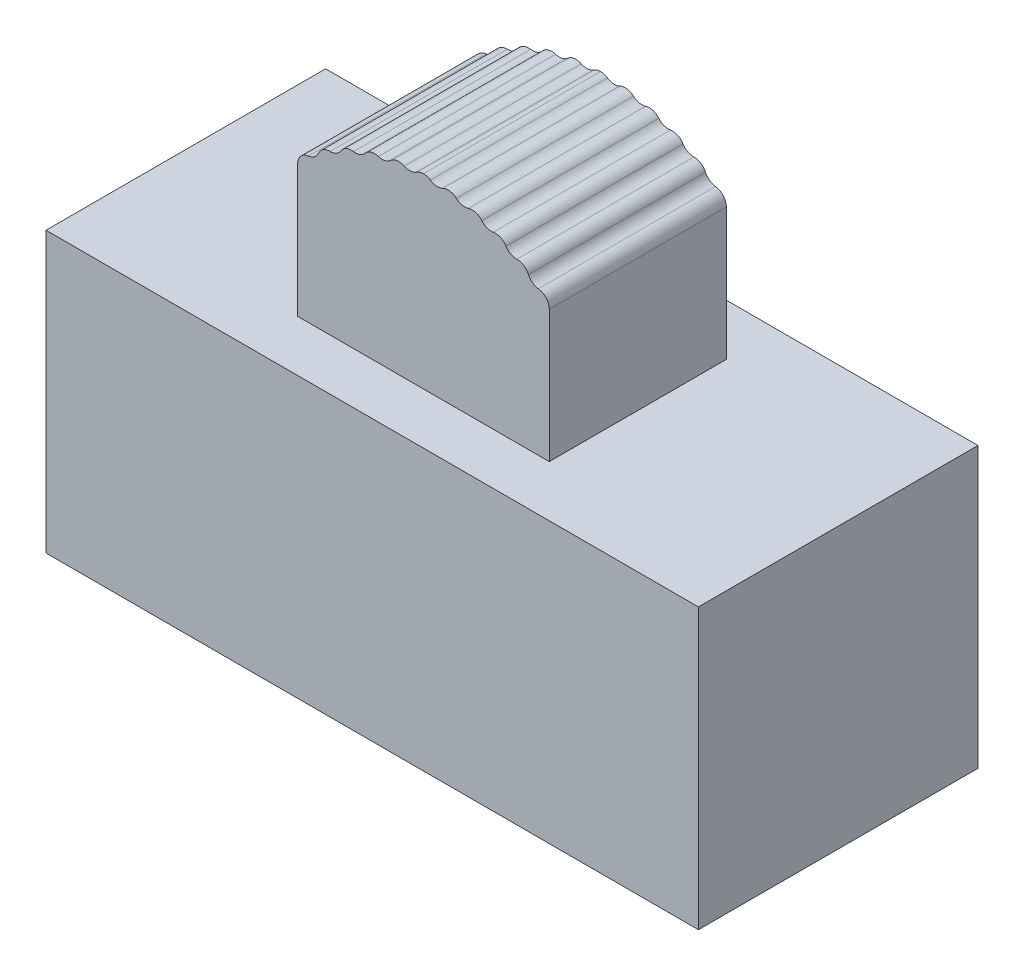
ISO-10303-21;
HEADER;
FILE_DESCRIPTION(('STEP AP214'),'2;1');
FILE_NAME('part.step','',(''),(''),'','','');
FILE_SCHEMA(('AUTOMOTIVE_DESIGN { 1 0 10303 214 1 1 1 1 }'));
ENDSEC;
DATA;
#1=APPLICATION_CONTEXT('core data for automotive mechanical design processes');
#2=APPLICATION_PROTOCOL_DEFINITION('international standard','automotive_design',2000,#1);
#3=PRODUCT_CONTEXT('',#1,'mechanical');
#4=PRODUCT('Part','Part','',(#3));
#5=PRODUCT_RELATED_PRODUCT_CATEGORY('part','',(#4));
#6=PRODUCT_DEFINITION_FORMATION('','',#4);
#7=PRODUCT_DEFINITION_CONTEXT('part definition',#1,'design');
#8=PRODUCT_DEFINITION('design','',#6,#7);
#9=PRODUCT_DEFINITION_SHAPE('','',#8);
#10=(LENGTH_UNIT() NAMED_UNIT(*) SI_UNIT(.MILLI.,.METRE.));
#11=(NAMED_UNIT(*) PLANE_ANGLE_UNIT() SI_UNIT($,.RADIAN.));
#12=(NAMED_UNIT(*) SI_UNIT($,.STERADIAN.) SOLID_ANGLE_UNIT());
#13=UNCERTAINTY_MEASURE_WITH_UNIT(LENGTH_MEASURE(1.E-05),#10,'distance_accuracy_value','');
#14=(GEOMETRIC_REPRESENTATION_CONTEXT(3) GLOBAL_UNCERTAINTY_ASSIGNED_CONTEXT((#13)) GLOBAL_UNIT_ASSIGNED_CONTEXT((#10,
#11,#12)) REPRESENTATION_CONTEXT('',''));
#15=CARTESIAN_POINT('',(0.,0.,0.));
#16=DIRECTION('',(0.,0.,1.));
#17=DIRECTION('',(1.,0.,0.));
#18=AXIS2_PLACEMENT_3D('',#15,#16,#17);
#19=CARTESIAN_POINT('',(-2.7,10.,1.9));
#20=DIRECTION('',(0.,0.,-1.));
#21=DIRECTION('',(-1.,0.,0.));
#22=AXIS2_PLACEMENT_3D('',#19,#20,#21);
#23=PLANE('',#22);
#24=DIRECTION('',(0.,-1.,0.));
#25=VECTOR('',#24,1.);
#26=CARTESIAN_POINT('',(2.7,10.,1.9));
#27=LINE('',#26,#25);
#28=CARTESIAN_POINT('',(2.7,8.83213700233587,1.9));
#29=VERTEX_POINT('',#28);
#30=CARTESIAN_POINT('',(2.7,6.,1.9));
#31=VERTEX_POINT('',#30);
#32=EDGE_CURVE('E277',#29,#31,#27,.T.);
#33=ORIENTED_EDGE('',*,*,#32,.F.);
#34=CARTESIAN_POINT('',(2.435,8.83213700233587,1.9));
#35=DIRECTION('',(0.,0.,1.));
#36=DIRECTION('',(1.,0.,0.));
#37=AXIS2_PLACEMENT_3D('',#34,#35,#36);
#38=CIRCLE('',#37,0.265000000000001);
#39=CARTESIAN_POINT('',(2.46554808183589,9.09537038679944,1.9));
#40=VERTEX_POINT('',#39);
#41=EDGE_CURVE('E49',#40,#29,#38,.F.);
#42=ORIENTED_EDGE('',*,*,#41,.F.);
#43=CARTESIAN_POINT('',(2.49609616367178,9.35860377126302,1.9));
#44=DIRECTION('',(0.,0.,1.));
#45=DIRECTION('',(1.,0.,0.));
#46=AXIS2_PLACEMENT_3D('',#43,#44,#45);
#47=CIRCLE('',#46,0.265);
#48=CARTESIAN_POINT('',(2.25285532468423,9.253442493938,1.9));
#49=VERTEX_POINT('',#48);
#50=EDGE_CURVE('E512',#40,#49,#47,.F.);
#51=ORIENTED_EDGE('',*,*,#50,.T.);
#52=CARTESIAN_POINT('',(2.00961448569667,9.14828121661298,1.9));
#53=DIRECTION('',(0.,0.,1.));
#54=DIRECTION('',(1.,0.,0.));
#55=AXIS2_PLACEMENT_3D('',#52,#53,#54);
#56=CIRCLE('',#55,0.265);
#57=CARTESIAN_POINT('',(2.0025960831141,9.41318826073448,1.9));
#58=VERTEX_POINT('',#57);
#59=EDGE_CURVE('E516',#58,#49,#56,.F.);
#60=ORIENTED_EDGE('',*,*,#59,.F.);
#61=CARTESIAN_POINT('',(1.99557768053153,9.67809530485597,1.9));
#62=DIRECTION('',(0.,0.,1.));
#63=DIRECTION('',(1.,0.,0.));
#64=AXIS2_PLACEMENT_3D('',#61,#62,#63);
#65=CIRCLE('',#64,0.265);
#66=CARTESIAN_POINT('',(1.76967065197215,9.53956366786473,1.9));
#67=VERTEX_POINT('',#66);
#68=EDGE_CURVE('E372',#58,#67,#65,.F.);
#69=ORIENTED_EDGE('',*,*,#68,.T.);
#70=CARTESIAN_POINT('',(1.54376362341278,9.40103203087349,1.9));
#71=DIRECTION('',(0.,0.,1.));
#72=DIRECTION('',(1.,0.,0.));
#73=AXIS2_PLACEMENT_3D('',#70,#71,#72);
#74=CIRCLE('',#73,0.265);
#75=CARTESIAN_POINT('',(1.49932005809547,9.66227859927562,1.9));
#76=VERTEX_POINT('',#75);
#77=EDGE_CURVE('E519',#76,#67,#74,.F.);
#78=ORIENTED_EDGE('',*,*,#77,.F.);
#79=CARTESIAN_POINT('',(1.45487649277817,9.92352516767774,1.9));
#80=DIRECTION('',(0.,0.,1.));
#81=DIRECTION('',(1.,0.,0.));
#82=AXIS2_PLACEMENT_3D('',#79,#80,#81);
#83=CIRCLE('',#82,0.265);
#84=CARTESIAN_POINT('',(1.25085211054907,9.75441262687714,1.9));
#85=VERTEX_POINT('',#84);
#86=EDGE_CURVE('E522',#76,#85,#83,.F.);
#87=ORIENTED_EDGE('',*,*,#86,.T.);
#88=CARTESIAN_POINT('',(1.04682772831997,9.58530008607654,1.9));
#89=DIRECTION('',(0.,0.,1.));
#90=DIRECTION('',(1.,0.,0.));
#91=AXIS2_PLACEMENT_3D('',#88,#89,#90);
#92=CIRCLE('',#91,0.264999999999999);
#93=CARTESIAN_POINT('',(0.965853910385703,9.83762575026698,1.9));
#94=VERTEX_POINT('',#93);
#95=EDGE_CURVE('E525',#94,#85,#92,.F.);
#96=ORIENTED_EDGE('',*,*,#95,.F.);
#97=CARTESIAN_POINT('',(0.884880092451435,10.0899514144574,1.9));
#98=DIRECTION('',(0.,0.,1.));
#99=DIRECTION('',(1.,0.,0.));
#100=AXIS2_PLACEMENT_3D('',#97,#98,#99);
#101=CIRCLE('',#100,0.265);
#102=CARTESIAN_POINT('',(0.706846566202864,9.89366319898971,1.9));
#103=VERTEX_POINT('',#102);
#104=EDGE_CURVE('E528',#94,#103,#101,.F.);
#105=ORIENTED_EDGE('',*,*,#104,.T.);
#106=CARTESIAN_POINT('',(0.528813039954295,9.697374983522,1.9));
#107=DIRECTION('',(0.,0.,1.));
#108=DIRECTION('',(1.,0.,0.));
#109=AXIS2_PLACEMENT_3D('',#106,#107,#108);
#110=CIRCLE('',#109,0.265);
#111=CARTESIAN_POINT('',(0.412939448155752,9.93569894522897,1.9));
#112=VERTEX_POINT('',#111);
#113=EDGE_CURVE('E531',#112,#103,#110,.F.);
#114=ORIENTED_EDGE('',*,*,#113,.F.);
#115=CARTESIAN_POINT('',(0.29706585635721,10.1740229069359,1.9));
#116=DIRECTION('',(0.,0.,1.));
#117=DIRECTION('',(1.,0.,0.));
#118=AXIS2_PLACEMENT_3D('',#115,#116,#117);
#119=CIRCLE('',#118,0.264999999999999);
#120=CARTESIAN_POINT('',(0.148608047087697,9.95451145195717,1.9));
#121=VERTEX_POINT('',#120);
#122=EDGE_CURVE('E250',#112,#121,#119,.F.);
#123=ORIENTED_EDGE('',*,*,#122,.T.);
#124=CARTESIAN_POINT('',(0.000150237818182658,9.7349999969784,1.9));
#125=DIRECTION('',(0.,0.,1.));
#126=DIRECTION('',(1.,0.,0.));
#127=AXIS2_PLACEMENT_3D('',#124,#125,#126);
#128=CIRCLE('',#127,0.265);
#129=CARTESIAN_POINT('',(0.000160897261775262,10.,1.9));
#130=VERTEX_POINT('',#129);
#131=EDGE_CURVE('E235',#130,#121,#128,.F.);
#132=ORIENTED_EDGE('',*,*,#131,.F.);
#133=DIRECTION('',(1.,0.,0.));
#134=VECTOR('',#133,1.);
#135=CARTESIAN_POINT('',(-2.7,10.,1.9));
#136=LINE('',#135,#134);
#137=CARTESIAN_POINT('',(-0.000160897261775213,10.,1.9));
#138=VERTEX_POINT('',#137);
#139=EDGE_CURVE('E247',#138,#130,#136,.T.);
#140=ORIENTED_EDGE('',*,*,#139,.F.);
#141=CARTESIAN_POINT('',(-0.000150237818182658,9.7349999969784,1.9));
#142=DIRECTION('',(0.,0.,1.));
#143=DIRECTION('',(1.,0.,0.));
#144=AXIS2_PLACEMENT_3D('',#141,#142,#143);
#145=CIRCLE('',#144,0.265);
#146=CARTESIAN_POINT('',(-0.148608047087696,9.95451145195717,1.9));
#147=VERTEX_POINT('',#146);
#148=EDGE_CURVE('E57',#138,#147,#145,.T.);
#149=ORIENTED_EDGE('',*,*,#148,.T.);
#150=CARTESIAN_POINT('',(-0.29706585635721,10.1740229069359,1.9));
#151=DIRECTION('',(0.,0.,1.));
#152=DIRECTION('',(1.,0.,0.));
#153=AXIS2_PLACEMENT_3D('',#150,#151,#152);
#154=CIRCLE('',#153,0.264999999999999);
#155=CARTESIAN_POINT('',(-0.412939448155752,9.93569894522897,1.9));
#156=VERTEX_POINT('',#155);
#157=EDGE_CURVE('E398',#156,#147,#154,.T.);
#158=ORIENTED_EDGE('',*,*,#157,.F.);
#159=CARTESIAN_POINT('',(-0.528813039954295,9.697374983522,1.9));
#160=DIRECTION('',(0.,0.,1.));
#161=DIRECTION('',(1.,0.,0.));
#162=AXIS2_PLACEMENT_3D('',#159,#160,#161);
#163=CIRCLE('',#162,0.265);
#164=CARTESIAN_POINT('',(-0.706846566202865,9.89366319898971,1.9));
#165=VERTEX_POINT('',#164);
#166=EDGE_CURVE('E395',#156,#165,#163,.T.);
#167=ORIENTED_EDGE('',*,*,#166,.T.);
#168=CARTESIAN_POINT('',(-0.884880092451435,10.0899514144574,1.9));
#169=DIRECTION('',(0.,0.,1.));
#170=DIRECTION('',(1.,0.,0.));
#171=AXIS2_PLACEMENT_3D('',#168,#169,#170);
#172=CIRCLE('',#171,0.265);
#173=CARTESIAN_POINT('',(-0.965853910385703,9.83762575026698,1.9));
#174=VERTEX_POINT('',#173);
#175=EDGE_CURVE('E423',#174,#165,#172,.T.);
#176=ORIENTED_EDGE('',*,*,#175,.F.);
#177=CARTESIAN_POINT('',(-1.04682772831997,9.58530008607654,1.9));
#178=DIRECTION('',(0.,0.,1.));
#179=DIRECTION('',(1.,0.,0.));
#180=AXIS2_PLACEMENT_3D('',#177,#178,#179);
#181=CIRCLE('',#180,0.264999999999999);
#182=CARTESIAN_POINT('',(-1.25085211054907,9.75441262687714,1.9));
#183=VERTEX_POINT('',#182);
#184=EDGE_CURVE('E420',#174,#183,#181,.T.);
#185=ORIENTED_EDGE('',*,*,#184,.T.);
#186=CARTESIAN_POINT('',(-1.45487649277817,9.92352516767774,1.9));
#187=DIRECTION('',(0.,0.,1.));
#188=DIRECTION('',(1.,0.,0.));
#189=AXIS2_PLACEMENT_3D('',#186,#187,#188);
#190=CIRCLE('',#189,0.265);
#191=CARTESIAN_POINT('',(-1.49932005809547,9.66227859927562,1.9));
#192=VERTEX_POINT('',#191);
#193=EDGE_CURVE('E417',#192,#183,#190,.T.);
#194=ORIENTED_EDGE('',*,*,#193,.F.);
#195=CARTESIAN_POINT('',(-1.54376362341278,9.40103203087349,1.9));
#196=DIRECTION('',(0.,0.,1.));
#197=DIRECTION('',(1.,0.,0.));
#198=AXIS2_PLACEMENT_3D('',#195,#196,#197);
#199=CIRCLE('',#198,0.265);
#200=CARTESIAN_POINT('',(-1.76967065197215,9.53956366786473,1.9));
#201=VERTEX_POINT('',#200);
#202=EDGE_CURVE('E414',#192,#201,#199,.T.);
#203=ORIENTED_EDGE('',*,*,#202,.T.);
#204=CARTESIAN_POINT('',(-1.99557768053153,9.67809530485597,1.9));
#205=DIRECTION('',(0.,0.,1.));
#206=DIRECTION('',(1.,0.,0.));
#207=AXIS2_PLACEMENT_3D('',#204,#205,#206);
#208=CIRCLE('',#207,0.265);
#209=CARTESIAN_POINT('',(-2.0025960831141,9.41318826073448,1.9));
#210=VERTEX_POINT('',#209);
#211=EDGE_CURVE('E411',#210,#201,#208,.T.);
#212=ORIENTED_EDGE('',*,*,#211,.F.);
#213=CARTESIAN_POINT('',(-2.00961448569667,9.14828121661298,1.9));
#214=DIRECTION('',(0.,0.,1.));
#215=DIRECTION('',(1.,0.,0.));
#216=AXIS2_PLACEMENT_3D('',#213,#214,#215);
#217=CIRCLE('',#216,0.265);
#218=CARTESIAN_POINT('',(-2.25285532468423,9.253442493938,1.9));
#219=VERTEX_POINT('',#218);
#220=EDGE_CURVE('E408',#210,#219,#217,.T.);
#221=ORIENTED_EDGE('',*,*,#220,.T.);
#222=CARTESIAN_POINT('',(-2.49609616367178,9.35860377126302,1.9));
#223=DIRECTION('',(0.,0.,1.));
#224=DIRECTION('',(1.,0.,0.));
#225=AXIS2_PLACEMENT_3D('',#222,#223,#224);
#226=CIRCLE('',#225,0.265);
#227=CARTESIAN_POINT('',(-2.46554808183589,9.09537038679944,1.9));
#228=VERTEX_POINT('',#227);
#229=EDGE_CURVE('E405',#228,#219,#226,.T.);
#230=ORIENTED_EDGE('',*,*,#229,.F.);
#231=CARTESIAN_POINT('',(-2.435,8.83213700233587,1.9));
#232=DIRECTION('',(0.,0.,1.));
#233=DIRECTION('',(1.,0.,0.));
#234=AXIS2_PLACEMENT_3D('',#231,#232,#233);
#235=CIRCLE('',#234,0.265000000000001);
#236=CARTESIAN_POINT('',(-2.7,8.83213700233587,1.9));
#237=VERTEX_POINT('',#236);
#238=EDGE_CURVE('E402',#228,#237,#235,.T.);
#239=ORIENTED_EDGE('',*,*,#238,.T.);
#240=DIRECTION('',(0.,-1.,0.));
#241=VECTOR('',#240,1.);
#242=CARTESIAN_POINT('',(-2.7,10.,1.9));
#243=LINE('',#242,#241);
#244=CARTESIAN_POINT('',(-2.7,6.,1.9));
#245=VERTEX_POINT('',#244);
#246=EDGE_CURVE('E279',#237,#245,#243,.T.);
#247=ORIENTED_EDGE('',*,*,#246,.T.);
#248=DIRECTION('',(1.,0.,0.));
#249=VECTOR('',#248,1.);
#250=CARTESIAN_POINT('',(-2.7,6.,1.9));
#251=LINE('',#250,#249);
#252=EDGE_CURVE('E269',#245,#31,#251,.T.);
#253=ORIENTED_EDGE('',*,*,#252,.T.);
#254=EDGE_LOOP('',(#33,#42,#51,#60,#69,#78,#87,#96,#105,#114,#123,#132,#140,#149,#158,#167,#176,
#185,#194,#203,#212,#221,#230,#239,#247,#253));
#255=FACE_BOUND('',#254,.T.);
#256=ADVANCED_FACE('F34',(#255),#23,.F.);
#257=CARTESIAN_POINT('',(-2.7,10.,-1.9));
#258=DIRECTION('',(0.,0.,1.));
#259=DIRECTION('',(1.,0.,0.));
#260=AXIS2_PLACEMENT_3D('',#257,#258,#259);
#261=PLANE('',#260);
#262=CARTESIAN_POINT('',(2.49609616367178,9.35860377126302,-1.9));
#263=DIRECTION('',(0.,0.,1.));
#264=DIRECTION('',(1.,0.,0.));
#265=AXIS2_PLACEMENT_3D('',#262,#263,#264);
#266=CIRCLE('',#265,0.265);
#267=CARTESIAN_POINT('',(2.46554808183589,9.09537038679944,-1.9));
#268=VERTEX_POINT('',#267);
#269=CARTESIAN_POINT('',(2.25285532468423,9.253442493938,-1.9));
#270=VERTEX_POINT('',#269);
#271=EDGE_CURVE('E12',#268,#270,#266,.F.);
#272=ORIENTED_EDGE('',*,*,#271,.F.);
#273=CARTESIAN_POINT('',(2.435,8.83213700233587,-1.9));
#274=DIRECTION('',(0.,0.,1.));
#275=DIRECTION('',(1.,0.,0.));
#276=AXIS2_PLACEMENT_3D('',#273,#274,#275);
#277=CIRCLE('',#276,0.265000000000001);
#278=CARTESIAN_POINT('',(2.7,8.83213700233587,-1.9));
#279=VERTEX_POINT('',#278);
#280=EDGE_CURVE('E392',#268,#279,#277,.F.);
#281=ORIENTED_EDGE('',*,*,#280,.T.);
#282=DIRECTION('',(0.,-1.,0.));
#283=VECTOR('',#282,1.);
#284=CARTESIAN_POINT('',(2.7,10.,-1.9));
#285=LINE('',#284,#283);
#286=CARTESIAN_POINT('',(2.7,6.,-1.9));
#287=VERTEX_POINT('',#286);
#288=EDGE_CURVE('E275',#279,#287,#285,.T.);
#289=ORIENTED_EDGE('',*,*,#288,.T.);
#290=DIRECTION('',(-1.,0.,0.));
#291=VECTOR('',#290,1.);
#292=CARTESIAN_POINT('',(-2.7,6.,-1.9));
#293=LINE('',#292,#291);
#294=CARTESIAN_POINT('',(-2.7,6.,-1.9));
#295=VERTEX_POINT('',#294);
#296=EDGE_CURVE('E255',#287,#295,#293,.T.);
#297=ORIENTED_EDGE('',*,*,#296,.T.);
#298=DIRECTION('',(0.,-1.,0.));
#299=VECTOR('',#298,1.);
#300=CARTESIAN_POINT('',(-2.7,10.,-1.9));
#301=LINE('',#300,#299);
#302=CARTESIAN_POINT('',(-2.7,8.83213700233587,-1.9));
#303=VERTEX_POINT('',#302);
#304=EDGE_CURVE('E257',#303,#295,#301,.T.);
#305=ORIENTED_EDGE('',*,*,#304,.F.);
#306=CARTESIAN_POINT('',(-2.435,8.83213700233587,-1.9));
#307=DIRECTION('',(0.,0.,1.));
#308=DIRECTION('',(1.,0.,0.));
#309=AXIS2_PLACEMENT_3D('',#306,#307,#308);
#310=CIRCLE('',#309,0.265000000000001);
#311=CARTESIAN_POINT('',(-2.46554808183589,9.09537038679944,-1.9));
#312=VERTEX_POINT('',#311);
#313=EDGE_CURVE('E334',#312,#303,#310,.T.);
#314=ORIENTED_EDGE('',*,*,#313,.F.);
#315=CARTESIAN_POINT('',(-2.49609616367178,9.35860377126302,-1.9));
#316=DIRECTION('',(0.,0.,1.));
#317=DIRECTION('',(1.,0.,0.));
#318=AXIS2_PLACEMENT_3D('',#315,#316,#317);
#319=CIRCLE('',#318,0.265);
#320=CARTESIAN_POINT('',(-2.25285532468423,9.253442493938,-1.9));
#321=VERTEX_POINT('',#320);
#322=EDGE_CURVE('E331',#312,#321,#319,.T.);
#323=ORIENTED_EDGE('',*,*,#322,.T.);
#324=CARTESIAN_POINT('',(-2.00961448569667,9.14828121661298,-1.9));
#325=DIRECTION('',(0.,0.,1.));
#326=DIRECTION('',(1.,0.,0.));
#327=AXIS2_PLACEMENT_3D('',#324,#325,#326);
#328=CIRCLE('',#327,0.265);
#329=CARTESIAN_POINT('',(-2.0025960831141,9.41318826073448,-1.9));
#330=VERTEX_POINT('',#329);
#331=EDGE_CURVE('E329',#330,#321,#328,.T.);
#332=ORIENTED_EDGE('',*,*,#331,.F.);
#333=CARTESIAN_POINT('',(-1.99557768053153,9.67809530485597,-1.9));
#334=DIRECTION('',(0.,0.,1.));
#335=DIRECTION('',(1.,0.,0.));
#336=AXIS2_PLACEMENT_3D('',#333,#334,#335);
#337=CIRCLE('',#336,0.265);
#338=CARTESIAN_POINT('',(-1.76967065197215,9.53956366786473,-1.9));
#339=VERTEX_POINT('',#338);
#340=EDGE_CURVE('E326',#330,#339,#337,.T.);
#341=ORIENTED_EDGE('',*,*,#340,.T.);
#342=CARTESIAN_POINT('',(-1.54376362341278,9.40103203087349,-1.9));
#343=DIRECTION('',(0.,0.,1.));
#344=DIRECTION('',(1.,0.,0.));
#345=AXIS2_PLACEMENT_3D('',#342,#343,#344);
#346=CIRCLE('',#345,0.265);
#347=CARTESIAN_POINT('',(-1.49932005809547,9.66227859927562,-1.9));
#348=VERTEX_POINT('',#347);
#349=EDGE_CURVE('E324',#348,#339,#346,.T.);
#350=ORIENTED_EDGE('',*,*,#349,.F.);
#351=CARTESIAN_POINT('',(-1.45487649277817,9.92352516767774,-1.9));
#352=DIRECTION('',(0.,0.,1.));
#353=DIRECTION('',(1.,0.,0.));
#354=AXIS2_PLACEMENT_3D('',#351,#352,#353);
#355=CIRCLE('',#354,0.265);
#356=CARTESIAN_POINT('',(-1.25085211054907,9.75441262687714,-1.9));
#357=VERTEX_POINT('',#356);
#358=EDGE_CURVE('E321',#348,#357,#355,.T.);
#359=ORIENTED_EDGE('',*,*,#358,.T.);
#360=CARTESIAN_POINT('',(-1.04682772831997,9.58530008607654,-1.9));
#361=DIRECTION('',(0.,0.,1.));
#362=DIRECTION('',(1.,0.,0.));
#363=AXIS2_PLACEMENT_3D('',#360,#361,#362);
#364=CIRCLE('',#363,0.264999999999999);
#365=CARTESIAN_POINT('',(-0.965853910385703,9.83762575026698,-1.9));
#366=VERTEX_POINT('',#365);
#367=EDGE_CURVE('E319',#366,#357,#364,.T.);
#368=ORIENTED_EDGE('',*,*,#367,.F.);
#369=CARTESIAN_POINT('',(-0.884880092451435,10.0899514144574,-1.9));
#370=DIRECTION('',(0.,0.,1.));
#371=DIRECTION('',(1.,0.,0.));
#372=AXIS2_PLACEMENT_3D('',#369,#370,#371);
#373=CIRCLE('',#372,0.265);
#374=CARTESIAN_POINT('',(-0.706846566202865,9.89366319898971,-1.9));
#375=VERTEX_POINT('',#374);
#376=EDGE_CURVE('E316',#366,#375,#373,.T.);
#377=ORIENTED_EDGE('',*,*,#376,.T.);
#378=CARTESIAN_POINT('',(-0.528813039954295,9.697374983522,-1.9));
#379=DIRECTION('',(0.,0.,1.));
#380=DIRECTION('',(1.,0.,0.));
#381=AXIS2_PLACEMENT_3D('',#378,#379,#380);
#382=CIRCLE('',#381,0.265);
#383=CARTESIAN_POINT('',(-0.412939448155752,9.93569894522897,-1.9));
#384=VERTEX_POINT('',#383);
#385=EDGE_CURVE('E314',#384,#375,#382,.T.);
#386=ORIENTED_EDGE('',*,*,#385,.F.);
#387=CARTESIAN_POINT('',(-0.29706585635721,10.1740229069359,-1.9));
#388=DIRECTION('',(0.,0.,1.));
#389=DIRECTION('',(1.,0.,0.));
#390=AXIS2_PLACEMENT_3D('',#387,#388,#389);
#391=CIRCLE('',#390,0.264999999999999);
#392=CARTESIAN_POINT('',(-0.148608047087696,9.95451145195717,-1.9));
#393=VERTEX_POINT('',#392);
#394=EDGE_CURVE('E311',#384,#393,#391,.T.);
#395=ORIENTED_EDGE('',*,*,#394,.T.);
#396=CARTESIAN_POINT('',(-0.000150237818182658,9.7349999969784,-1.9));
#397=DIRECTION('',(0.,0.,1.));
#398=DIRECTION('',(1.,0.,0.));
#399=AXIS2_PLACEMENT_3D('',#396,#397,#398);
#400=CIRCLE('',#399,0.265);
#401=CARTESIAN_POINT('',(-0.000160897261775262,10.,-1.9));
#402=VERTEX_POINT('',#401);
#403=EDGE_CURVE('E263',#402,#393,#400,.T.);
#404=ORIENTED_EDGE('',*,*,#403,.F.);
#405=DIRECTION('',(-1.,0.,0.));
#406=VECTOR('',#405,1.);
#407=CARTESIAN_POINT('',(-2.7,10.,-1.9));
#408=LINE('',#407,#406);
#409=CARTESIAN_POINT('',(0.000160897261775262,10.,-1.9));
#410=VERTEX_POINT('',#409);
#411=EDGE_CURVE('E254',#410,#402,#408,.T.);
#412=ORIENTED_EDGE('',*,*,#411,.F.);
#413=CARTESIAN_POINT('',(0.000150237818182658,9.7349999969784,-1.9));
#414=DIRECTION('',(0.,0.,1.));
#415=DIRECTION('',(1.,0.,0.));
#416=AXIS2_PLACEMENT_3D('',#413,#414,#415);
#417=CIRCLE('',#416,0.265);
#418=CARTESIAN_POINT('',(0.148608047087697,9.95451145195717,-1.9));
#419=VERTEX_POINT('',#418);
#420=EDGE_CURVE('E238',#410,#419,#417,.F.);
#421=ORIENTED_EDGE('',*,*,#420,.T.);
#422=CARTESIAN_POINT('',(0.29706585635721,10.1740229069359,-1.9));
#423=DIRECTION('',(0.,0.,1.));
#424=DIRECTION('',(1.,0.,0.));
#425=AXIS2_PLACEMENT_3D('',#422,#423,#424);
#426=CIRCLE('',#425,0.264999999999999);
#427=CARTESIAN_POINT('',(0.412939448155752,9.93569894522897,-1.9));
#428=VERTEX_POINT('',#427);
#429=EDGE_CURVE('E338',#428,#419,#426,.F.);
#430=ORIENTED_EDGE('',*,*,#429,.F.);
#431=CARTESIAN_POINT('',(0.528813039954295,9.697374983522,-1.9));
#432=DIRECTION('',(0.,0.,1.));
#433=DIRECTION('',(1.,0.,0.));
#434=AXIS2_PLACEMENT_3D('',#431,#432,#433);
#435=CIRCLE('',#434,0.265);
#436=CARTESIAN_POINT('',(0.706846566202864,9.89366319898971,-1.9));
#437=VERTEX_POINT('',#436);
#438=EDGE_CURVE('E340',#428,#437,#435,.F.);
#439=ORIENTED_EDGE('',*,*,#438,.T.);
#440=CARTESIAN_POINT('',(0.884880092451435,10.0899514144574,-1.9));
#441=DIRECTION('',(0.,0.,1.));
#442=DIRECTION('',(1.,0.,0.));
#443=AXIS2_PLACEMENT_3D('',#440,#441,#442);
#444=CIRCLE('',#443,0.265);
#445=CARTESIAN_POINT('',(0.965853910385703,9.83762575026698,-1.9));
#446=VERTEX_POINT('',#445);
#447=EDGE_CURVE('E343',#446,#437,#444,.F.);
#448=ORIENTED_EDGE('',*,*,#447,.F.);
#449=CARTESIAN_POINT('',(1.04682772831997,9.58530008607654,-1.9));
#450=DIRECTION('',(0.,0.,1.));
#451=DIRECTION('',(1.,0.,0.));
#452=AXIS2_PLACEMENT_3D('',#449,#450,#451);
#453=CIRCLE('',#452,0.264999999999999);
#454=CARTESIAN_POINT('',(1.25085211054907,9.75441262687714,-1.9));
#455=VERTEX_POINT('',#454);
#456=EDGE_CURVE('E345',#446,#455,#453,.F.);
#457=ORIENTED_EDGE('',*,*,#456,.T.);
#458=CARTESIAN_POINT('',(1.45487649277817,9.92352516767774,-1.9));
#459=DIRECTION('',(0.,0.,1.));
#460=DIRECTION('',(1.,0.,0.));
#461=AXIS2_PLACEMENT_3D('',#458,#459,#460);
#462=CIRCLE('',#461,0.265);
#463=CARTESIAN_POINT('',(1.49932005809547,9.66227859927562,-1.9));
#464=VERTEX_POINT('',#463);
#465=EDGE_CURVE('E348',#464,#455,#462,.F.);
#466=ORIENTED_EDGE('',*,*,#465,.F.);
#467=CARTESIAN_POINT('',(1.54376362341278,9.40103203087349,-1.9));
#468=DIRECTION('',(0.,0.,1.));
#469=DIRECTION('',(1.,0.,0.));
#470=AXIS2_PLACEMENT_3D('',#467,#468,#469);
#471=CIRCLE('',#470,0.265);
#472=CARTESIAN_POINT('',(1.76967065197215,9.53956366786473,-1.9));
#473=VERTEX_POINT('',#472);
#474=EDGE_CURVE('E350',#464,#473,#471,.F.);
#475=ORIENTED_EDGE('',*,*,#474,.T.);
#476=CARTESIAN_POINT('',(1.99557768053153,9.67809530485597,-1.9));
#477=DIRECTION('',(0.,0.,1.));
#478=DIRECTION('',(1.,0.,0.));
#479=AXIS2_PLACEMENT_3D('',#476,#477,#478);
#480=CIRCLE('',#479,0.265);
#481=CARTESIAN_POINT('',(2.0025960831141,9.41318826073448,-1.9));
#482=VERTEX_POINT('',#481);
#483=EDGE_CURVE('E353',#482,#473,#480,.F.);
#484=ORIENTED_EDGE('',*,*,#483,.F.);
#485=CARTESIAN_POINT('',(2.00961448569667,9.14828121661298,-1.9));
#486=DIRECTION('',(0.,0.,1.));
#487=DIRECTION('',(1.,0.,0.));
#488=AXIS2_PLACEMENT_3D('',#485,#486,#487);
#489=CIRCLE('',#488,0.265);
#490=EDGE_CURVE('E42',#482,#270,#489,.F.);
#491=ORIENTED_EDGE('',*,*,#490,.T.);
#492=EDGE_LOOP('',(#272,#281,#289,#297,#305,#314,#323,#332,#341,#350,#359,#368,#377,#386,#395,
#404,#412,#421,#430,#439,#448,#457,#466,#475,#484,#491));
#493=FACE_BOUND('',#492,.T.);
#494=ADVANCED_FACE('F358',(#493),#261,.F.);
#495=CARTESIAN_POINT('',(2.7,10.,-1.9));
#496=DIRECTION('',(-1.,0.,0.));
#497=DIRECTION('',(0.,0.,1.));
#498=AXIS2_PLACEMENT_3D('',#495,#496,#497);
#499=PLANE('',#498);
#500=DIRECTION('',(0.,0.,1.));
#501=VECTOR('',#500,1.);
#502=CARTESIAN_POINT('',(2.7,8.83213700233587,-3.));
#503=LINE('',#502,#501);
#504=EDGE_CURVE('E336',#29,#279,#503,.F.);
#505=ORIENTED_EDGE('',*,*,#504,.F.);
#506=ORIENTED_EDGE('',*,*,#32,.T.);
#507=DIRECTION('',(0.,0.,-1.));
#508=VECTOR('',#507,1.);
#509=CARTESIAN_POINT('',(2.7,6.,-1.9));
#510=LINE('',#509,#508);
#511=EDGE_CURVE('E260',#31,#287,#510,.T.);
#512=ORIENTED_EDGE('',*,*,#511,.T.);
#513=ORIENTED_EDGE('',*,*,#288,.F.);
#514=EDGE_LOOP('',(#505,#506,#512,#513));
#515=FACE_BOUND('',#514,.T.);
#516=ADVANCED_FACE('F506',(#515),#499,.F.);
#517=CARTESIAN_POINT('',(-2.7,10.,-1.9));
#518=DIRECTION('',(1.,0.,0.));
#519=DIRECTION('',(0.,0.,-1.));
#520=AXIS2_PLACEMENT_3D('',#517,#518,#519);
#521=PLANE('',#520);
#522=DIRECTION('',(0.,0.,1.));
#523=VECTOR('',#522,1.);
#524=CARTESIAN_POINT('',(-2.7,8.83213700233587,-3.));
#525=LINE('',#524,#523);
#526=EDGE_CURVE('E443',#303,#237,#525,.T.);
#527=ORIENTED_EDGE('',*,*,#526,.F.);
#528=ORIENTED_EDGE('',*,*,#304,.T.);
#529=DIRECTION('',(0.,0.,1.));
#530=VECTOR('',#529,1.);
#531=CARTESIAN_POINT('',(-2.7,6.,-1.9));
#532=LINE('',#531,#530);
#533=EDGE_CURVE('E266',#295,#245,#532,.T.);
#534=ORIENTED_EDGE('',*,*,#533,.T.);
#535=ORIENTED_EDGE('',*,*,#246,.F.);
#536=EDGE_LOOP('',(#527,#528,#534,#535));
#537=FACE_BOUND('',#536,.T.);
#538=ADVANCED_FACE('F496',(#537),#521,.F.);
#539=CARTESIAN_POINT('',(0.,10.,0.));
#540=DIRECTION('',(0.,1.,0.));
#541=DIRECTION('',(0.,0.,1.));
#542=AXIS2_PLACEMENT_3D('',#539,#540,#541);
#543=PLANE('',#542);
#544=DIRECTION('',(0.,0.,1.));
#545=VECTOR('',#544,1.);
#546=CARTESIAN_POINT('',(0.000160897261775262,10.,-3.));
#547=LINE('',#546,#545);
#548=EDGE_CURVE('E231',#410,#130,#547,.T.);
#549=ORIENTED_EDGE('',*,*,#548,.F.);
#550=ORIENTED_EDGE('',*,*,#411,.T.);
#551=DIRECTION('',(0.,0.,1.));
#552=VECTOR('',#551,1.);
#553=CARTESIAN_POINT('',(-0.000160897261775262,10.,-3.));
#554=LINE('',#553,#552);
#555=EDGE_CURVE('E253',#402,#138,#554,.T.);
#556=ORIENTED_EDGE('',*,*,#555,.T.);
#557=ORIENTED_EDGE('',*,*,#139,.T.);
#558=EDGE_LOOP('',(#549,#550,#556,#557));
#559=FACE_BOUND('',#558,.T.);
#560=ADVANCED_FACE('F252',(#559),#543,.T.);
#561=CARTESIAN_POINT('',(0.,6.,0.));
#562=DIRECTION('',(0.,1.,0.));
#563=DIRECTION('',(0.,0.,1.));
#564=AXIS2_PLACEMENT_3D('',#561,#562,#563);
#565=PLANE('',#564);
#566=DIRECTION('',(0.,0.,1.));
#567=VECTOR('',#566,1.);
#568=CARTESIAN_POINT('',(-7.,6.,-3.));
#569=LINE('',#568,#567);
#570=CARTESIAN_POINT('',(-7.,6.,-3.));
#571=VERTEX_POINT('',#570);
#572=CARTESIAN_POINT('',(-7.,6.,3.));
#573=VERTEX_POINT('',#572);
#574=EDGE_CURVE('E282',#571,#573,#569,.T.);
#575=ORIENTED_EDGE('',*,*,#574,.T.);
#576=DIRECTION('',(1.,0.,0.));
#577=VECTOR('',#576,1.);
#578=CARTESIAN_POINT('',(-7.,6.,3.));
#579=LINE('',#578,#577);
#580=CARTESIAN_POINT('',(7.,6.,3.));
#581=VERTEX_POINT('',#580);
#582=EDGE_CURVE('E285',#573,#581,#579,.T.);
#583=ORIENTED_EDGE('',*,*,#582,.T.);
#584=DIRECTION('',(0.,0.,-1.));
#585=VECTOR('',#584,1.);
#586=CARTESIAN_POINT('',(7.,6.,-3.));
#587=LINE('',#586,#585);
#588=CARTESIAN_POINT('',(7.,6.,-3.));
#589=VERTEX_POINT('',#588);
#590=EDGE_CURVE('E288',#581,#589,#587,.T.);
#591=ORIENTED_EDGE('',*,*,#590,.T.);
#592=DIRECTION('',(-1.,0.,0.));
#593=VECTOR('',#592,1.);
#594=CARTESIAN_POINT('',(-7.,6.,-3.));
#595=LINE('',#594,#593);
#596=EDGE_CURVE('E290',#589,#571,#595,.T.);
#597=ORIENTED_EDGE('',*,*,#596,.T.);
#598=EDGE_LOOP('',(#575,#583,#591,#597));
#599=FACE_BOUND('',#598,.T.);
#600=ORIENTED_EDGE('',*,*,#252,.F.);
#601=ORIENTED_EDGE('',*,*,#533,.F.);
#602=ORIENTED_EDGE('',*,*,#296,.F.);
#603=ORIENTED_EDGE('',*,*,#511,.F.);
#604=EDGE_LOOP('',(#600,#601,#602,#603));
#605=FACE_BOUND('',#604,.T.);
#606=ADVANCED_FACE('F503',(#599,#605),#565,.T.);
#607=CARTESIAN_POINT('',(-7.,6.,-3.));
#608=DIRECTION('',(1.,0.,0.));
#609=DIRECTION('',(0.,0.,-1.));
#610=AXIS2_PLACEMENT_3D('',#607,#608,#609);
#611=PLANE('',#610);
#612=DIRECTION('',(0.,0.,1.));
#613=VECTOR('',#612,1.);
#614=CARTESIAN_POINT('',(-7.,0.,-3.));
#615=LINE('',#614,#613);
#616=CARTESIAN_POINT('',(-7.,0.,-3.));
#617=VERTEX_POINT('',#616);
#618=CARTESIAN_POINT('',(-7.,0.,3.));
#619=VERTEX_POINT('',#618);
#620=EDGE_CURVE('E281',#617,#619,#615,.T.);
#621=ORIENTED_EDGE('',*,*,#620,.T.);
#622=DIRECTION('',(0.,-1.,0.));
#623=VECTOR('',#622,1.);
#624=CARTESIAN_POINT('',(-7.,6.,3.));
#625=LINE('',#624,#623);
#626=EDGE_CURVE('E308',#573,#619,#625,.T.);
#627=ORIENTED_EDGE('',*,*,#626,.F.);
#628=ORIENTED_EDGE('',*,*,#574,.F.);
#629=DIRECTION('',(0.,-1.,0.));
#630=VECTOR('',#629,1.);
#631=CARTESIAN_POINT('',(-7.,6.,-3.));
#632=LINE('',#631,#630);
#633=EDGE_CURVE('E292',#571,#617,#632,.T.);
#634=ORIENTED_EDGE('',*,*,#633,.T.);
#635=EDGE_LOOP('',(#621,#627,#628,#634));
#636=FACE_BOUND('',#635,.T.);
#637=ADVANCED_FACE('F36',(#636),#611,.F.);
#638=CARTESIAN_POINT('',(-7.,6.,3.));
#639=DIRECTION('',(0.,0.,-1.));
#640=DIRECTION('',(-1.,0.,0.));
#641=AXIS2_PLACEMENT_3D('',#638,#639,#640);
#642=PLANE('',#641);
#643=DIRECTION('',(1.,0.,0.));
#644=VECTOR('',#643,1.);
#645=CARTESIAN_POINT('',(-7.,0.,3.));
#646=LINE('',#645,#644);
#647=CARTESIAN_POINT('',(7.,0.,3.));
#648=VERTEX_POINT('',#647);
#649=EDGE_CURVE('E295',#619,#648,#646,.T.);
#650=ORIENTED_EDGE('',*,*,#649,.T.);
#651=DIRECTION('',(0.,-1.,0.));
#652=VECTOR('',#651,1.);
#653=CARTESIAN_POINT('',(7.,6.,3.));
#654=LINE('',#653,#652);
#655=EDGE_CURVE('E305',#581,#648,#654,.T.);
#656=ORIENTED_EDGE('',*,*,#655,.F.);
#657=ORIENTED_EDGE('',*,*,#582,.F.);
#658=ORIENTED_EDGE('',*,*,#626,.T.);
#659=EDGE_LOOP('',(#650,#656,#657,#658));
#660=FACE_BOUND('',#659,.T.);
#661=ADVANCED_FACE('F582',(#660),#642,.F.);
#662=CARTESIAN_POINT('',(7.,6.,-3.));
#663=DIRECTION('',(-1.,0.,0.));
#664=DIRECTION('',(0.,0.,1.));
#665=AXIS2_PLACEMENT_3D('',#662,#663,#664);
#666=PLANE('',#665);
#667=DIRECTION('',(0.,0.,-1.));
#668=VECTOR('',#667,1.);
#669=CARTESIAN_POINT('',(7.,0.,-3.));
#670=LINE('',#669,#668);
#671=CARTESIAN_POINT('',(7.,0.,-3.));
#672=VERTEX_POINT('',#671);
#673=EDGE_CURVE('E297',#648,#672,#670,.T.);
#674=ORIENTED_EDGE('',*,*,#673,.T.);
#675=DIRECTION('',(0.,-1.,0.));
#676=VECTOR('',#675,1.);
#677=CARTESIAN_POINT('',(7.,6.,-3.));
#678=LINE('',#677,#676);
#679=EDGE_CURVE('E302',#589,#672,#678,.T.);
#680=ORIENTED_EDGE('',*,*,#679,.F.);
#681=ORIENTED_EDGE('',*,*,#590,.F.);
#682=ORIENTED_EDGE('',*,*,#655,.T.);
#683=EDGE_LOOP('',(#674,#680,#681,#682));
#684=FACE_BOUND('',#683,.T.);
#685=ADVANCED_FACE('F579',(#684),#666,.F.);
#686=CARTESIAN_POINT('',(-7.,6.,-3.));
#687=DIRECTION('',(0.,0.,1.));
#688=DIRECTION('',(1.,0.,0.));
#689=AXIS2_PLACEMENT_3D('',#686,#687,#688);
#690=PLANE('',#689);
#691=DIRECTION('',(-1.,0.,0.));
#692=VECTOR('',#691,1.);
#693=CARTESIAN_POINT('',(-7.,0.,-3.));
#694=LINE('',#693,#692);
#695=EDGE_CURVE('E286',#672,#617,#694,.T.);
#696=ORIENTED_EDGE('',*,*,#695,.T.);
#697=ORIENTED_EDGE('',*,*,#633,.F.);
#698=ORIENTED_EDGE('',*,*,#596,.F.);
#699=ORIENTED_EDGE('',*,*,#679,.T.);
#700=EDGE_LOOP('',(#696,#697,#698,#699));
#701=FACE_BOUND('',#700,.T.);
#702=ADVANCED_FACE('F575',(#701),#690,.F.);
#703=CARTESIAN_POINT('',(0.,0.,0.));
#704=DIRECTION('',(0.,1.,0.));
#705=DIRECTION('',(0.,0.,1.));
#706=AXIS2_PLACEMENT_3D('',#703,#704,#705);
#707=PLANE('',#706);
#708=ORIENTED_EDGE('',*,*,#620,.F.);
#709=ORIENTED_EDGE('',*,*,#695,.F.);
#710=ORIENTED_EDGE('',*,*,#673,.F.);
#711=ORIENTED_EDGE('',*,*,#649,.F.);
#712=EDGE_LOOP('',(#708,#709,#710,#711));
#713=FACE_BOUND('',#712,.T.);
#714=ADVANCED_FACE('F572',(#713),#707,.F.);
#715=CARTESIAN_POINT('',(-0.528813039954295,9.697374983522,-3.));
#716=DIRECTION('',(0.,0.,1.));
#717=DIRECTION('',(1.,0.,0.));
#718=AXIS2_PLACEMENT_3D('',#715,#716,#717);
#719=CYLINDRICAL_SURFACE('',#718,0.265);
#720=ORIENTED_EDGE('',*,*,#385,.T.);
#721=DIRECTION('',(0.,0.,1.));
#722=VECTOR('',#721,1.);
#723=CARTESIAN_POINT('',(-0.706846566202865,9.89366319898971,-3.));
#724=LINE('',#723,#722);
#725=EDGE_CURVE('E427',#375,#165,#724,.T.);
#726=ORIENTED_EDGE('',*,*,#725,.T.);
#727=ORIENTED_EDGE('',*,*,#166,.F.);
#728=DIRECTION('',(0.,0.,1.));
#729=VECTOR('',#728,1.);
#730=CARTESIAN_POINT('',(-0.412939448155752,9.93569894522897,-3.));
#731=LINE('',#730,#729);
#732=EDGE_CURVE('E426',#384,#156,#731,.T.);
#733=ORIENTED_EDGE('',*,*,#732,.F.);
#734=EDGE_LOOP('',(#720,#726,#727,#733));
#735=FACE_BOUND('',#734,.T.);
#736=ADVANCED_FACE('F455',(#735),#719,.T.);
#737=CARTESIAN_POINT('',(-0.884880092451435,10.0899514144574,-3.));
#738=DIRECTION('',(0.,0.,1.));
#739=DIRECTION('',(1.,0.,0.));
#740=AXIS2_PLACEMENT_3D('',#737,#738,#739);
#741=CYLINDRICAL_SURFACE('',#740,0.265);
#742=DIRECTION('',(0.,0.,1.));
#743=VECTOR('',#742,1.);
#744=CARTESIAN_POINT('',(-0.965853910385703,9.83762575026698,-3.));
#745=LINE('',#744,#743);
#746=EDGE_CURVE('E429',#366,#174,#745,.T.);
#747=ORIENTED_EDGE('',*,*,#746,.T.);
#748=ORIENTED_EDGE('',*,*,#175,.T.);
#749=ORIENTED_EDGE('',*,*,#725,.F.);
#750=ORIENTED_EDGE('',*,*,#376,.F.);
#751=EDGE_LOOP('',(#747,#748,#749,#750));
#752=FACE_BOUND('',#751,.T.);
#753=ADVANCED_FACE('F461',(#752),#741,.F.);
#754=CARTESIAN_POINT('',(-1.04682772831997,9.58530008607654,-3.));
#755=DIRECTION('',(0.,0.,1.));
#756=DIRECTION('',(1.,0.,0.));
#757=AXIS2_PLACEMENT_3D('',#754,#755,#756);
#758=CYLINDRICAL_SURFACE('',#757,0.264999999999999);
#759=ORIENTED_EDGE('',*,*,#367,.T.);
#760=DIRECTION('',(0.,0.,1.));
#761=VECTOR('',#760,1.);
#762=CARTESIAN_POINT('',(-1.25085211054907,9.75441262687714,-3.));
#763=LINE('',#762,#761);
#764=EDGE_CURVE('E431',#357,#183,#763,.T.);
#765=ORIENTED_EDGE('',*,*,#764,.T.);
#766=ORIENTED_EDGE('',*,*,#184,.F.);
#767=ORIENTED_EDGE('',*,*,#746,.F.);
#768=EDGE_LOOP('',(#759,#765,#766,#767));
#769=FACE_BOUND('',#768,.T.);
#770=ADVANCED_FACE('F465',(#769),#758,.T.);
#771=CARTESIAN_POINT('',(-1.45487649277817,9.92352516767774,-3.));
#772=DIRECTION('',(0.,0.,1.));
#773=DIRECTION('',(1.,0.,0.));
#774=AXIS2_PLACEMENT_3D('',#771,#772,#773);
#775=CYLINDRICAL_SURFACE('',#774,0.265);
#776=DIRECTION('',(0.,0.,1.));
#777=VECTOR('',#776,1.);
#778=CARTESIAN_POINT('',(-1.49932005809547,9.66227859927562,-3.));
#779=LINE('',#778,#777);
#780=EDGE_CURVE('E433',#348,#192,#779,.T.);
#781=ORIENTED_EDGE('',*,*,#780,.T.);
#782=ORIENTED_EDGE('',*,*,#193,.T.);
#783=ORIENTED_EDGE('',*,*,#764,.F.);
#784=ORIENTED_EDGE('',*,*,#358,.F.);
#785=EDGE_LOOP('',(#781,#782,#783,#784));
#786=FACE_BOUND('',#785,.T.);
#787=ADVANCED_FACE('F468',(#786),#775,.F.);
#788=CARTESIAN_POINT('',(-1.54376362341278,9.40103203087349,-3.));
#789=DIRECTION('',(0.,0.,1.));
#790=DIRECTION('',(1.,0.,0.));
#791=AXIS2_PLACEMENT_3D('',#788,#789,#790);
#792=CYLINDRICAL_SURFACE('',#791,0.265);
#793=ORIENTED_EDGE('',*,*,#349,.T.);
#794=DIRECTION('',(0.,0.,1.));
#795=VECTOR('',#794,1.);
#796=CARTESIAN_POINT('',(-1.76967065197215,9.53956366786473,-3.));
#797=LINE('',#796,#795);
#798=EDGE_CURVE('E435',#339,#201,#797,.T.);
#799=ORIENTED_EDGE('',*,*,#798,.T.);
#800=ORIENTED_EDGE('',*,*,#202,.F.);
#801=ORIENTED_EDGE('',*,*,#780,.F.);
#802=EDGE_LOOP('',(#793,#799,#800,#801));
#803=FACE_BOUND('',#802,.T.);
#804=ADVANCED_FACE('F473',(#803),#792,.T.);
#805=CARTESIAN_POINT('',(-1.99557768053153,9.67809530485597,-3.));
#806=DIRECTION('',(0.,0.,1.));
#807=DIRECTION('',(1.,0.,0.));
#808=AXIS2_PLACEMENT_3D('',#805,#806,#807);
#809=CYLINDRICAL_SURFACE('',#808,0.265);
#810=DIRECTION('',(0.,0.,1.));
#811=VECTOR('',#810,1.);
#812=CARTESIAN_POINT('',(-2.0025960831141,9.41318826073448,-3.));
#813=LINE('',#812,#811);
#814=EDGE_CURVE('E437',#330,#210,#813,.T.);
#815=ORIENTED_EDGE('',*,*,#814,.T.);
#816=ORIENTED_EDGE('',*,*,#211,.T.);
#817=ORIENTED_EDGE('',*,*,#798,.F.);
#818=ORIENTED_EDGE('',*,*,#340,.F.);
#819=EDGE_LOOP('',(#815,#816,#817,#818));
#820=FACE_BOUND('',#819,.T.);
#821=ADVANCED_FACE('F477',(#820),#809,.F.);
#822=CARTESIAN_POINT('',(-2.00961448569667,9.14828121661298,-3.));
#823=DIRECTION('',(0.,0.,1.));
#824=DIRECTION('',(1.,0.,0.));
#825=AXIS2_PLACEMENT_3D('',#822,#823,#824);
#826=CYLINDRICAL_SURFACE('',#825,0.265);
#827=ORIENTED_EDGE('',*,*,#331,.T.);
#828=DIRECTION('',(0.,0.,1.));
#829=VECTOR('',#828,1.);
#830=CARTESIAN_POINT('',(-2.25285532468423,9.253442493938,-3.));
#831=LINE('',#830,#829);
#832=EDGE_CURVE('E439',#321,#219,#831,.T.);
#833=ORIENTED_EDGE('',*,*,#832,.T.);
#834=ORIENTED_EDGE('',*,*,#220,.F.);
#835=ORIENTED_EDGE('',*,*,#814,.F.);
#836=EDGE_LOOP('',(#827,#833,#834,#835));
#837=FACE_BOUND('',#836,.T.);
#838=ADVANCED_FACE('F482',(#837),#826,.T.);
#839=CARTESIAN_POINT('',(-2.49609616367178,9.35860377126302,-3.));
#840=DIRECTION('',(0.,0.,1.));
#841=DIRECTION('',(1.,0.,0.));
#842=AXIS2_PLACEMENT_3D('',#839,#840,#841);
#843=CYLINDRICAL_SURFACE('',#842,0.265);
#844=DIRECTION('',(0.,0.,1.));
#845=VECTOR('',#844,1.);
#846=CARTESIAN_POINT('',(-2.46554808183589,9.09537038679944,-3.));
#847=LINE('',#846,#845);
#848=EDGE_CURVE('E441',#312,#228,#847,.T.);
#849=ORIENTED_EDGE('',*,*,#848,.T.);
#850=ORIENTED_EDGE('',*,*,#229,.T.);
#851=ORIENTED_EDGE('',*,*,#832,.F.);
#852=ORIENTED_EDGE('',*,*,#322,.F.);
#853=EDGE_LOOP('',(#849,#850,#851,#852));
#854=FACE_BOUND('',#853,.T.);
#855=ADVANCED_FACE('F488',(#854),#843,.F.);
#856=CARTESIAN_POINT('',(-2.435,8.83213700233587,-3.));
#857=DIRECTION('',(0.,0.,1.));
#858=DIRECTION('',(1.,0.,0.));
#859=AXIS2_PLACEMENT_3D('',#856,#857,#858);
#860=CYLINDRICAL_SURFACE('',#859,0.265000000000001);
#861=ORIENTED_EDGE('',*,*,#313,.T.);
#862=ORIENTED_EDGE('',*,*,#526,.T.);
#863=ORIENTED_EDGE('',*,*,#238,.F.);
#864=ORIENTED_EDGE('',*,*,#848,.F.);
#865=EDGE_LOOP('',(#861,#862,#863,#864));
#866=FACE_BOUND('',#865,.T.);
#867=ADVANCED_FACE('F492',(#866),#860,.T.);
#868=CARTESIAN_POINT('',(-0.29706585635721,10.1740229069359,-3.));
#869=DIRECTION('',(0.,0.,1.));
#870=DIRECTION('',(1.,0.,0.));
#871=AXIS2_PLACEMENT_3D('',#868,#869,#870);
#872=CYLINDRICAL_SURFACE('',#871,0.264999999999999);
#873=ORIENTED_EDGE('',*,*,#732,.T.);
#874=ORIENTED_EDGE('',*,*,#157,.T.);
#875=DIRECTION('',(0.,0.,1.));
#876=VECTOR('',#875,1.);
#877=CARTESIAN_POINT('',(-0.148608047087696,9.95451145195717,-3.));
#878=LINE('',#877,#876);
#879=EDGE_CURVE('E445',#393,#147,#878,.T.);
#880=ORIENTED_EDGE('',*,*,#879,.F.);
#881=ORIENTED_EDGE('',*,*,#394,.F.);
#882=EDGE_LOOP('',(#873,#874,#880,#881));
#883=FACE_BOUND('',#882,.T.);
#884=ADVANCED_FACE('F450',(#883),#872,.F.);
#885=CARTESIAN_POINT('',(-0.000150237818182658,9.7349999969784,-3.));
#886=DIRECTION('',(0.,0.,1.));
#887=DIRECTION('',(1.,0.,0.));
#888=AXIS2_PLACEMENT_3D('',#885,#886,#887);
#889=CYLINDRICAL_SURFACE('',#888,0.265);
#890=ORIENTED_EDGE('',*,*,#403,.T.);
#891=ORIENTED_EDGE('',*,*,#879,.T.);
#892=ORIENTED_EDGE('',*,*,#148,.F.);
#893=ORIENTED_EDGE('',*,*,#555,.F.);
#894=EDGE_LOOP('',(#890,#891,#892,#893));
#895=FACE_BOUND('',#894,.T.);
#896=ADVANCED_FACE('F549',(#895),#889,.T.);
#897=CARTESIAN_POINT('',(2.49609616367178,9.35860377126302,-3.));
#898=DIRECTION('',(0.,0.,1.));
#899=DIRECTION('',(1.,0.,0.));
#900=AXIS2_PLACEMENT_3D('',#897,#898,#899);
#901=CYLINDRICAL_SURFACE('',#900,0.265);
#902=ORIENTED_EDGE('',*,*,#271,.T.);
#903=DIRECTION('',(0.,0.,1.));
#904=VECTOR('',#903,1.);
#905=CARTESIAN_POINT('',(2.25285532468423,9.253442493938,-3.));
#906=LINE('',#905,#904);
#907=EDGE_CURVE('E367',#270,#49,#906,.T.);
#908=ORIENTED_EDGE('',*,*,#907,.T.);
#909=ORIENTED_EDGE('',*,*,#50,.F.);
#910=DIRECTION('',(0.,0.,1.));
#911=VECTOR('',#910,1.);
#912=CARTESIAN_POINT('',(2.46554808183589,9.09537038679944,-3.));
#913=LINE('',#912,#911);
#914=EDGE_CURVE('E376',#268,#40,#913,.T.);
#915=ORIENTED_EDGE('',*,*,#914,.F.);
#916=EDGE_LOOP('',(#902,#908,#909,#915));
#917=FACE_BOUND('',#916,.T.);
#918=ADVANCED_FACE('F511',(#917),#901,.F.);
#919=CARTESIAN_POINT('',(2.00961448569667,9.14828121661298,-3.));
#920=DIRECTION('',(0.,0.,1.));
#921=DIRECTION('',(1.,0.,0.));
#922=AXIS2_PLACEMENT_3D('',#919,#920,#921);
#923=CYLINDRICAL_SURFACE('',#922,0.265);
#924=DIRECTION('',(0.,0.,1.));
#925=VECTOR('',#924,1.);
#926=CARTESIAN_POINT('',(2.0025960831141,9.41318826073448,-3.));
#927=LINE('',#926,#925);
#928=EDGE_CURVE('E365',#482,#58,#927,.T.);
#929=ORIENTED_EDGE('',*,*,#928,.T.);
#930=ORIENTED_EDGE('',*,*,#59,.T.);
#931=ORIENTED_EDGE('',*,*,#907,.F.);
#932=ORIENTED_EDGE('',*,*,#490,.F.);
#933=EDGE_LOOP('',(#929,#930,#931,#932));
#934=FACE_BOUND('',#933,.T.);
#935=ADVANCED_FACE('F363',(#934),#923,.T.);
#936=CARTESIAN_POINT('',(1.99557768053153,9.67809530485597,-3.));
#937=DIRECTION('',(0.,0.,1.));
#938=DIRECTION('',(1.,0.,0.));
#939=AXIS2_PLACEMENT_3D('',#936,#937,#938);
#940=CYLINDRICAL_SURFACE('',#939,0.265);
#941=ORIENTED_EDGE('',*,*,#483,.T.);
#942=DIRECTION('',(0.,0.,1.));
#943=VECTOR('',#942,1.);
#944=CARTESIAN_POINT('',(1.76967065197215,9.53956366786473,-3.));
#945=LINE('',#944,#943);
#946=EDGE_CURVE('E374',#473,#67,#945,.T.);
#947=ORIENTED_EDGE('',*,*,#946,.T.);
#948=ORIENTED_EDGE('',*,*,#68,.F.);
#949=ORIENTED_EDGE('',*,*,#928,.F.);
#950=EDGE_LOOP('',(#941,#947,#948,#949));
#951=FACE_BOUND('',#950,.T.);
#952=ADVANCED_FACE('F369',(#951),#940,.F.);
#953=CARTESIAN_POINT('',(1.54376362341278,9.40103203087349,-3.));
#954=DIRECTION('',(0.,0.,1.));
#955=DIRECTION('',(1.,0.,0.));
#956=AXIS2_PLACEMENT_3D('',#953,#954,#955);
#957=CYLINDRICAL_SURFACE('',#956,0.265);
#958=DIRECTION('',(0.,0.,1.));
#959=VECTOR('',#958,1.);
#960=CARTESIAN_POINT('',(1.49932005809547,9.66227859927562,-3.));
#961=LINE('',#960,#959);
#962=EDGE_CURVE('E378',#464,#76,#961,.T.);
#963=ORIENTED_EDGE('',*,*,#962,.T.);
#964=ORIENTED_EDGE('',*,*,#77,.T.);
#965=ORIENTED_EDGE('',*,*,#946,.F.);
#966=ORIENTED_EDGE('',*,*,#474,.F.);
#967=EDGE_LOOP('',(#963,#964,#965,#966));
#968=FACE_BOUND('',#967,.T.);
#969=ADVANCED_FACE('F723',(#968),#957,.T.);
#970=CARTESIAN_POINT('',(1.45487649277817,9.92352516767774,-3.));
#971=DIRECTION('',(0.,0.,1.));
#972=DIRECTION('',(1.,0.,0.));
#973=AXIS2_PLACEMENT_3D('',#970,#971,#972);
#974=CYLINDRICAL_SURFACE('',#973,0.265);
#975=ORIENTED_EDGE('',*,*,#465,.T.);
#976=DIRECTION('',(0.,0.,1.));
#977=VECTOR('',#976,1.);
#978=CARTESIAN_POINT('',(1.25085211054907,9.75441262687714,-3.));
#979=LINE('',#978,#977);
#980=EDGE_CURVE('E383',#455,#85,#979,.T.);
#981=ORIENTED_EDGE('',*,*,#980,.T.);
#982=ORIENTED_EDGE('',*,*,#86,.F.);
#983=ORIENTED_EDGE('',*,*,#962,.F.);
#984=EDGE_LOOP('',(#975,#981,#982,#983));
#985=FACE_BOUND('',#984,.T.);
#986=ADVANCED_FACE('F731',(#985),#974,.F.);
#987=CARTESIAN_POINT('',(1.04682772831997,9.58530008607654,-3.));
#988=DIRECTION('',(0.,0.,1.));
#989=DIRECTION('',(1.,0.,0.));
#990=AXIS2_PLACEMENT_3D('',#987,#988,#989);
#991=CYLINDRICAL_SURFACE('',#990,0.264999999999999);
#992=DIRECTION('',(0.,0.,1.));
#993=VECTOR('',#992,1.);
#994=CARTESIAN_POINT('',(0.965853910385703,9.83762575026698,-3.));
#995=LINE('',#994,#993);
#996=EDGE_CURVE('E385',#446,#94,#995,.T.);
#997=ORIENTED_EDGE('',*,*,#996,.T.);
#998=ORIENTED_EDGE('',*,*,#95,.T.);
#999=ORIENTED_EDGE('',*,*,#980,.F.);
#1000=ORIENTED_EDGE('',*,*,#456,.F.);
#1001=EDGE_LOOP('',(#997,#998,#999,#1000));
#1002=FACE_BOUND('',#1001,.T.);
#1003=ADVANCED_FACE('F740',(#1002),#991,.T.);
#1004=CARTESIAN_POINT('',(0.884880092451435,10.0899514144574,-3.));
#1005=DIRECTION('',(0.,0.,1.));
#1006=DIRECTION('',(1.,0.,0.));
#1007=AXIS2_PLACEMENT_3D('',#1004,#1005,#1006);
#1008=CYLINDRICAL_SURFACE('',#1007,0.265);
#1009=ORIENTED_EDGE('',*,*,#447,.T.);
#1010=DIRECTION('',(0.,0.,1.));
#1011=VECTOR('',#1010,1.);
#1012=CARTESIAN_POINT('',(0.706846566202864,9.89366319898971,-3.));
#1013=LINE('',#1012,#1011);
#1014=EDGE_CURVE('E387',#437,#103,#1013,.T.);
#1015=ORIENTED_EDGE('',*,*,#1014,.T.);
#1016=ORIENTED_EDGE('',*,*,#104,.F.);
#1017=ORIENTED_EDGE('',*,*,#996,.F.);
#1018=EDGE_LOOP('',(#1009,#1015,#1016,#1017));
#1019=FACE_BOUND('',#1018,.T.);
#1020=ADVANCED_FACE('F542',(#1019),#1008,.F.);
#1021=CARTESIAN_POINT('',(0.528813039954295,9.697374983522,-3.));
#1022=DIRECTION('',(0.,0.,1.));
#1023=DIRECTION('',(1.,0.,0.));
#1024=AXIS2_PLACEMENT_3D('',#1021,#1022,#1023);
#1025=CYLINDRICAL_SURFACE('',#1024,0.265);
#1026=DIRECTION('',(0.,0.,1.));
#1027=VECTOR('',#1026,1.);
#1028=CARTESIAN_POINT('',(0.412939448155752,9.93569894522897,-3.));
#1029=LINE('',#1028,#1027);
#1030=EDGE_CURVE('E389',#428,#112,#1029,.T.);
#1031=ORIENTED_EDGE('',*,*,#1030,.T.);
#1032=ORIENTED_EDGE('',*,*,#113,.T.);
#1033=ORIENTED_EDGE('',*,*,#1014,.F.);
#1034=ORIENTED_EDGE('',*,*,#438,.F.);
#1035=EDGE_LOOP('',(#1031,#1032,#1033,#1034));
#1036=FACE_BOUND('',#1035,.T.);
#1037=ADVANCED_FACE('F536',(#1036),#1025,.T.);
#1038=CARTESIAN_POINT('',(0.29706585635721,10.1740229069359,-3.));
#1039=DIRECTION('',(0.,0.,1.));
#1040=DIRECTION('',(1.,0.,0.));
#1041=AXIS2_PLACEMENT_3D('',#1038,#1039,#1040);
#1042=CYLINDRICAL_SURFACE('',#1041,0.264999999999999);
#1043=ORIENTED_EDGE('',*,*,#429,.T.);
#1044=DIRECTION('',(0.,0.,1.));
#1045=VECTOR('',#1044,1.);
#1046=CARTESIAN_POINT('',(0.148608047087697,9.95451145195717,-3.));
#1047=LINE('',#1046,#1045);
#1048=EDGE_CURVE('E242',#419,#121,#1047,.T.);
#1049=ORIENTED_EDGE('',*,*,#1048,.T.);
#1050=ORIENTED_EDGE('',*,*,#122,.F.);
#1051=ORIENTED_EDGE('',*,*,#1030,.F.);
#1052=EDGE_LOOP('',(#1043,#1049,#1050,#1051));
#1053=FACE_BOUND('',#1052,.T.);
#1054=ADVANCED_FACE('F547',(#1053),#1042,.F.);
#1055=CARTESIAN_POINT('',(0.000150237818182658,9.7349999969784,-3.));
#1056=DIRECTION('',(0.,0.,1.));
#1057=DIRECTION('',(1.,0.,0.));
#1058=AXIS2_PLACEMENT_3D('',#1055,#1056,#1057);
#1059=CYLINDRICAL_SURFACE('',#1058,0.265);
#1060=ORIENTED_EDGE('',*,*,#548,.T.);
#1061=ORIENTED_EDGE('',*,*,#131,.T.);
#1062=ORIENTED_EDGE('',*,*,#1048,.F.);
#1063=ORIENTED_EDGE('',*,*,#420,.F.);
#1064=EDGE_LOOP('',(#1060,#1061,#1062,#1063));
#1065=FACE_BOUND('',#1064,.T.);
#1066=ADVANCED_FACE('F233',(#1065),#1059,.T.);
#1067=CARTESIAN_POINT('',(2.435,8.83213700233587,-3.));
#1068=DIRECTION('',(0.,0.,1.));
#1069=DIRECTION('',(1.,0.,0.));
#1070=AXIS2_PLACEMENT_3D('',#1067,#1068,#1069);
#1071=CYLINDRICAL_SURFACE('',#1070,0.265000000000001);
#1072=ORIENTED_EDGE('',*,*,#914,.T.);
#1073=ORIENTED_EDGE('',*,*,#41,.T.);
#1074=ORIENTED_EDGE('',*,*,#504,.T.);
#1075=ORIENTED_EDGE('',*,*,#280,.F.);
#1076=EDGE_LOOP('',(#1072,#1073,#1074,#1075));
#1077=FACE_BOUND('',#1076,.T.);
#1078=ADVANCED_FACE('F507',(#1077),#1071,.T.);
#1079=CLOSED_SHELL('',(#256,#494,#516,#538,#560,#606,#637,#661,#685,#702,#714,#736,#753,#770,
#787,#804,#821,#838,#855,#867,#884,#896,#918,#935,#952,#969,#986,#1003,#1020,#1037,#1054,#1066,#1078));
#1080=MANIFOLD_SOLID_BREP('B2',#1079);
#1081=ADVANCED_BREP_SHAPE_REPRESENTATION('',(#18,#1080),#14);
#1082=SHAPE_DEFINITION_REPRESENTATION(#9,#1081);
ENDSEC;
END-ISO-10303-21;
